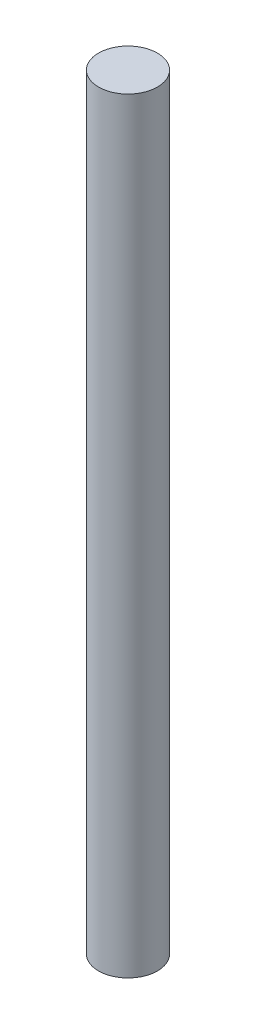
ISO-10303-21;
HEADER;
FILE_DESCRIPTION(('STEP AP214'),'2;1');
FILE_NAME('part.step','',(''),(''),'','','');
FILE_SCHEMA(('AUTOMOTIVE_DESIGN { 1 0 10303 214 1 1 1 1 }'));
ENDSEC;
DATA;
#1=APPLICATION_CONTEXT('core data for automotive mechanical design processes');
#2=APPLICATION_PROTOCOL_DEFINITION('international standard','automotive_design',2000,#1);
#3=PRODUCT_CONTEXT('',#1,'mechanical');
#4=PRODUCT('Part','Part','',(#3));
#5=PRODUCT_RELATED_PRODUCT_CATEGORY('part','',(#4));
#6=PRODUCT_DEFINITION_FORMATION('','',#4);
#7=PRODUCT_DEFINITION_CONTEXT('part definition',#1,'design');
#8=PRODUCT_DEFINITION('design','',#6,#7);
#9=PRODUCT_DEFINITION_SHAPE('','',#8);
#10=(LENGTH_UNIT() NAMED_UNIT(*) SI_UNIT(.MILLI.,.METRE.));
#11=(NAMED_UNIT(*) PLANE_ANGLE_UNIT() SI_UNIT($,.RADIAN.));
#12=(NAMED_UNIT(*) SI_UNIT($,.STERADIAN.) SOLID_ANGLE_UNIT());
#13=UNCERTAINTY_MEASURE_WITH_UNIT(LENGTH_MEASURE(1.E-05),#10,'distance_accuracy_value','');
#14=(GEOMETRIC_REPRESENTATION_CONTEXT(3) GLOBAL_UNCERTAINTY_ASSIGNED_CONTEXT((#13)) GLOBAL_UNIT_ASSIGNED_CONTEXT((#10,
#11,#12)) REPRESENTATION_CONTEXT('',''));
#15=CARTESIAN_POINT('',(0.,0.,0.));
#16=DIRECTION('',(0.,0.,1.));
#17=DIRECTION('',(1.,0.,0.));
#18=AXIS2_PLACEMENT_3D('',#15,#16,#17);
#19=CARTESIAN_POINT('',(0.,3962.4,0.));
#20=DIRECTION('',(0.,-1.,0.));
#21=DIRECTION('',(0.,0.,-1.));
#22=AXIS2_PLACEMENT_3D('',#19,#20,#21);
#23=CYLINDRICAL_SURFACE('',#22,152.4);
#24=CARTESIAN_POINT('',(0.,3962.4,0.));
#25=DIRECTION('',(0.,1.,0.));
#26=DIRECTION('',(0.,0.,1.));
#27=AXIS2_PLACEMENT_3D('',#24,#25,#26);
#28=CIRCLE('',#27,152.4);
#29=CARTESIAN_POINT('',(0.,3962.4,152.4));
#30=VERTEX_POINT('',#29);
#31=EDGE_CURVE('E10',#30,#30,#28,.T.);
#32=ORIENTED_EDGE('',*,*,#31,.F.);
#33=EDGE_LOOP('',(#32));
#34=FACE_BOUND('',#33,.T.);
#35=CARTESIAN_POINT('',(0.,0.,0.));
#36=DIRECTION('',(0.,1.,0.));
#37=DIRECTION('',(0.,0.,1.));
#38=AXIS2_PLACEMENT_3D('',#35,#36,#37);
#39=CIRCLE('',#38,152.4);
#40=CARTESIAN_POINT('',(0.,0.,152.4));
#41=VERTEX_POINT('',#40);
#42=EDGE_CURVE('E33',#41,#41,#39,.T.);
#43=ORIENTED_EDGE('',*,*,#42,.T.);
#44=EDGE_LOOP('',(#43));
#45=FACE_BOUND('',#44,.T.);
#46=ADVANCED_FACE('F30',(#34,#45),#23,.T.);
#47=CARTESIAN_POINT('',(0.,3962.4,0.));
#48=DIRECTION('',(0.,1.,0.));
#49=DIRECTION('',(0.,0.,1.));
#50=AXIS2_PLACEMENT_3D('',#47,#48,#49);
#51=PLANE('',#50);
#52=ORIENTED_EDGE('',*,*,#31,.T.);
#53=EDGE_LOOP('',(#52));
#54=FACE_BOUND('',#53,.T.);
#55=ADVANCED_FACE('F45',(#54),#51,.T.);
#56=CARTESIAN_POINT('',(0.,0.,0.));
#57=DIRECTION('',(0.,1.,0.));
#58=DIRECTION('',(0.,0.,1.));
#59=AXIS2_PLACEMENT_3D('',#56,#57,#58);
#60=PLANE('',#59);
#61=ORIENTED_EDGE('',*,*,#42,.F.);
#62=EDGE_LOOP('',(#61));
#63=FACE_BOUND('',#62,.T.);
#64=ADVANCED_FACE('F43',(#63),#60,.F.);
#65=CLOSED_SHELL('',(#46,#55,#64));
#66=MANIFOLD_SOLID_BREP('B2',#65);
#67=ADVANCED_BREP_SHAPE_REPRESENTATION('',(#18,#66),#14);
#68=SHAPE_DEFINITION_REPRESENTATION(#9,#67);
ENDSEC;
END-ISO-10303-21;
